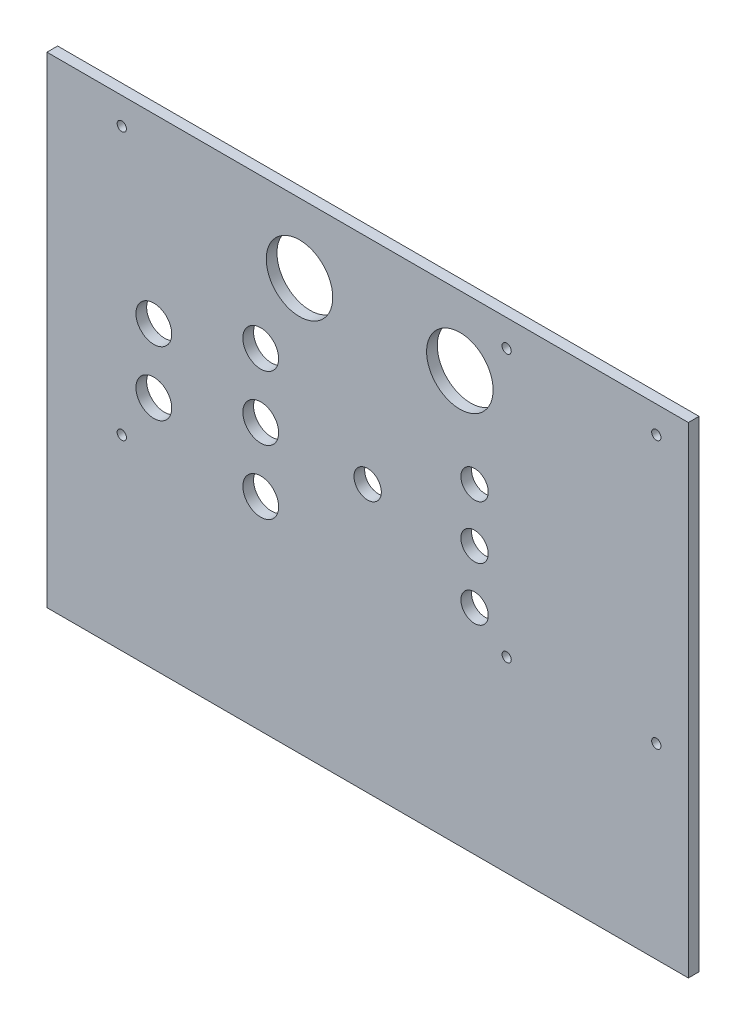
ISO-10303-21;
HEADER;
FILE_DESCRIPTION(('STEP AP214'),'2;1');
FILE_NAME('part.step','',(''),(''),'','','');
FILE_SCHEMA(('AUTOMOTIVE_DESIGN { 1 0 10303 214 1 1 1 1 }'));
ENDSEC;
DATA;
#1=APPLICATION_CONTEXT('core data for automotive mechanical design processes');
#2=APPLICATION_PROTOCOL_DEFINITION('international standard','automotive_design',2000,#1);
#3=PRODUCT_CONTEXT('',#1,'mechanical');
#4=PRODUCT('Part','Part','',(#3));
#5=PRODUCT_RELATED_PRODUCT_CATEGORY('part','',(#4));
#6=PRODUCT_DEFINITION_FORMATION('','',#4);
#7=PRODUCT_DEFINITION_CONTEXT('part definition',#1,'design');
#8=PRODUCT_DEFINITION('design','',#6,#7);
#9=PRODUCT_DEFINITION_SHAPE('','',#8);
#10=(LENGTH_UNIT() NAMED_UNIT(*) SI_UNIT(.MILLI.,.METRE.));
#11=(NAMED_UNIT(*) PLANE_ANGLE_UNIT() SI_UNIT($,.RADIAN.));
#12=(NAMED_UNIT(*) SI_UNIT($,.STERADIAN.) SOLID_ANGLE_UNIT());
#13=UNCERTAINTY_MEASURE_WITH_UNIT(LENGTH_MEASURE(1.E-05),#10,'distance_accuracy_value','');
#14=(GEOMETRIC_REPRESENTATION_CONTEXT(3) GLOBAL_UNCERTAINTY_ASSIGNED_CONTEXT((#13)) GLOBAL_UNIT_ASSIGNED_CONTEXT((#10,
#11,#12)) REPRESENTATION_CONTEXT('',''));
#15=CARTESIAN_POINT('',(0.,0.,0.));
#16=DIRECTION('',(0.,0.,1.));
#17=DIRECTION('',(1.,0.,0.));
#18=AXIS2_PLACEMENT_3D('',#15,#16,#17);
#19=CARTESIAN_POINT('',(0.,0.,2.54));
#20=DIRECTION('',(0.,0.,-1.));
#21=DIRECTION('',(-1.,0.,0.));
#22=AXIS2_PLACEMENT_3D('',#19,#20,#21);
#23=PLANE('',#22);
#24=DIRECTION('',(0.,-1.,0.));
#25=VECTOR('',#24,1.);
#26=CARTESIAN_POINT('',(0.,0.,2.54));
#27=LINE('',#26,#25);
#28=CARTESIAN_POINT('',(0.,114.3,2.54));
#29=VERTEX_POINT('',#28);
#30=CARTESIAN_POINT('',(0.,0.,2.54));
#31=VERTEX_POINT('',#30);
#32=EDGE_CURVE('E92',#29,#31,#27,.T.);
#33=ORIENTED_EDGE('',*,*,#32,.T.);
#34=DIRECTION('',(1.,0.,0.));
#35=VECTOR('',#34,1.);
#36=CARTESIAN_POINT('',(0.,0.,2.54));
#37=LINE('',#36,#35);
#38=CARTESIAN_POINT('',(152.4,0.,2.54));
#39=VERTEX_POINT('',#38);
#40=EDGE_CURVE('E87',#31,#39,#37,.T.);
#41=ORIENTED_EDGE('',*,*,#40,.T.);
#42=DIRECTION('',(0.,1.,0.));
#43=VECTOR('',#42,1.);
#44=CARTESIAN_POINT('',(152.4,0.,2.54));
#45=LINE('',#44,#43);
#46=CARTESIAN_POINT('',(152.4,114.3,2.54));
#47=VERTEX_POINT('',#46);
#48=EDGE_CURVE('E90',#39,#47,#45,.T.);
#49=ORIENTED_EDGE('',*,*,#48,.T.);
#50=DIRECTION('',(-1.,0.,0.));
#51=VECTOR('',#50,1.);
#52=CARTESIAN_POINT('',(0.,114.3,2.54));
#53=LINE('',#52,#51);
#54=EDGE_CURVE('E57',#47,#29,#53,.T.);
#55=ORIENTED_EDGE('',*,*,#54,.T.);
#56=EDGE_LOOP('',(#33,#41,#49,#55));
#57=FACE_BOUND('',#56,.T.);
#58=CARTESIAN_POINT('',(60.0071942494432,97.79,2.54));
#59=DIRECTION('',(0.,0.,1.));
#60=DIRECTION('',(1.,0.,0.));
#61=AXIS2_PLACEMENT_3D('',#58,#59,#60);
#62=CIRCLE('',#61,7.9);
#63=CARTESIAN_POINT('',(67.9071942494432,97.79,2.54));
#64=VERTEX_POINT('',#63);
#65=EDGE_CURVE('E112',#64,#64,#62,.T.);
#66=ORIENTED_EDGE('',*,*,#65,.F.);
#67=EDGE_LOOP('',(#66));
#68=FACE_BOUND('',#67,.T.);
#69=CARTESIAN_POINT('',(98.1071942494432,97.79,2.54));
#70=DIRECTION('',(0.,0.,1.));
#71=DIRECTION('',(1.,0.,0.));
#72=AXIS2_PLACEMENT_3D('',#69,#70,#71);
#73=CIRCLE('',#72,7.89999994800001);
#74=CARTESIAN_POINT('',(106.007194197443,97.79,2.54));
#75=VERTEX_POINT('',#74);
#76=EDGE_CURVE('E134',#75,#75,#73,.T.);
#77=ORIENTED_EDGE('',*,*,#76,.F.);
#78=EDGE_LOOP('',(#77));
#79=FACE_BOUND('',#78,.T.);
#80=CARTESIAN_POINT('',(50.8,78.74,2.54));
#81=DIRECTION('',(0.,0.,1.));
#82=DIRECTION('',(1.,0.,0.));
#83=AXIS2_PLACEMENT_3D('',#80,#81,#82);
#84=CIRCLE('',#83,4.25000000000001);
#85=CARTESIAN_POINT('',(55.05,78.74,2.54));
#86=VERTEX_POINT('',#85);
#87=EDGE_CURVE('E142',#86,#86,#84,.T.);
#88=ORIENTED_EDGE('',*,*,#87,.F.);
#89=EDGE_LOOP('',(#88));
#90=FACE_BOUND('',#89,.T.);
#91=CARTESIAN_POINT('',(25.4,71.12,2.54));
#92=DIRECTION('',(0.,0.,1.));
#93=DIRECTION('',(1.,0.,0.));
#94=AXIS2_PLACEMENT_3D('',#91,#92,#93);
#95=CIRCLE('',#94,4.25000000000001);
#96=CARTESIAN_POINT('',(29.65,71.12,2.54));
#97=VERTEX_POINT('',#96);
#98=EDGE_CURVE('E150',#97,#97,#95,.T.);
#99=ORIENTED_EDGE('',*,*,#98,.F.);
#100=EDGE_LOOP('',(#99));
#101=FACE_BOUND('',#100,.T.);
#102=CARTESIAN_POINT('',(50.8,63.5,2.54));
#103=DIRECTION('',(0.,0.,1.));
#104=DIRECTION('',(1.,0.,0.));
#105=AXIS2_PLACEMENT_3D('',#102,#103,#104);
#106=CIRCLE('',#105,4.25000000000001);
#107=CARTESIAN_POINT('',(55.05,63.5,2.54));
#108=VERTEX_POINT('',#107);
#109=EDGE_CURVE('E158',#108,#108,#106,.T.);
#110=ORIENTED_EDGE('',*,*,#109,.F.);
#111=EDGE_LOOP('',(#110));
#112=FACE_BOUND('',#111,.T.);
#113=CARTESIAN_POINT('',(101.6,63.5,2.54));
#114=DIRECTION('',(0.,0.,1.));
#115=DIRECTION('',(1.,0.,0.));
#116=AXIS2_PLACEMENT_3D('',#113,#114,#115);
#117=CIRCLE('',#116,3.25000000000001);
#118=CARTESIAN_POINT('',(104.85,63.5,2.54));
#119=VERTEX_POINT('',#118);
#120=EDGE_CURVE('E166',#119,#119,#117,.T.);
#121=ORIENTED_EDGE('',*,*,#120,.F.);
#122=EDGE_LOOP('',(#121));
#123=FACE_BOUND('',#122,.T.);
#124=CARTESIAN_POINT('',(50.8,48.26,2.54));
#125=DIRECTION('',(0.,0.,1.));
#126=DIRECTION('',(1.,0.,0.));
#127=AXIS2_PLACEMENT_3D('',#124,#125,#126);
#128=CIRCLE('',#127,4.25000000000001);
#129=CARTESIAN_POINT('',(55.05,48.26,2.54));
#130=VERTEX_POINT('',#129);
#131=EDGE_CURVE('E174',#130,#130,#128,.T.);
#132=ORIENTED_EDGE('',*,*,#131,.F.);
#133=EDGE_LOOP('',(#132));
#134=FACE_BOUND('',#133,.T.);
#135=CARTESIAN_POINT('',(25.4,55.88,2.54));
#136=DIRECTION('',(0.,0.,1.));
#137=DIRECTION('',(1.,0.,0.));
#138=AXIS2_PLACEMENT_3D('',#135,#136,#137);
#139=CIRCLE('',#138,4.25000000000001);
#140=CARTESIAN_POINT('',(29.65,55.88,2.54));
#141=VERTEX_POINT('',#140);
#142=EDGE_CURVE('E182',#141,#141,#139,.T.);
#143=ORIENTED_EDGE('',*,*,#142,.F.);
#144=EDGE_LOOP('',(#143));
#145=FACE_BOUND('',#144,.T.);
#146=CARTESIAN_POINT('',(101.6,50.8,2.54));
#147=DIRECTION('',(0.,0.,1.));
#148=DIRECTION('',(1.,0.,0.));
#149=AXIS2_PLACEMENT_3D('',#146,#147,#148);
#150=CIRCLE('',#149,3.25000000000001);
#151=CARTESIAN_POINT('',(104.85,50.8,2.54));
#152=VERTEX_POINT('',#151);
#153=EDGE_CURVE('E190',#152,#152,#150,.T.);
#154=ORIENTED_EDGE('',*,*,#153,.F.);
#155=EDGE_LOOP('',(#154));
#156=FACE_BOUND('',#155,.T.);
#157=CARTESIAN_POINT('',(17.78,44.45,2.54));
#158=DIRECTION('',(0.,0.,1.));
#159=DIRECTION('',(1.,0.,0.));
#160=AXIS2_PLACEMENT_3D('',#157,#158,#159);
#161=CIRCLE('',#160,1.09999999999999);
#162=CARTESIAN_POINT('',(18.88,44.45,2.54));
#163=VERTEX_POINT('',#162);
#164=EDGE_CURVE('E198',#163,#163,#161,.T.);
#165=ORIENTED_EDGE('',*,*,#164,.F.);
#166=EDGE_LOOP('',(#165));
#167=FACE_BOUND('',#166,.T.);
#168=CARTESIAN_POINT('',(17.78,107.95,2.54));
#169=DIRECTION('',(0.,0.,1.));
#170=DIRECTION('',(1.,0.,0.));
#171=AXIS2_PLACEMENT_3D('',#168,#169,#170);
#172=CIRCLE('',#171,1.1);
#173=CARTESIAN_POINT('',(18.88,107.95,2.54));
#174=VERTEX_POINT('',#173);
#175=EDGE_CURVE('E206',#174,#174,#172,.T.);
#176=ORIENTED_EDGE('',*,*,#175,.F.);
#177=EDGE_LOOP('',(#176));
#178=FACE_BOUND('',#177,.T.);
#179=CARTESIAN_POINT('',(109.22,107.95,2.54));
#180=DIRECTION('',(0.,0.,1.));
#181=DIRECTION('',(1.,0.,0.));
#182=AXIS2_PLACEMENT_3D('',#179,#180,#181);
#183=CIRCLE('',#182,1.10000000000001);
#184=CARTESIAN_POINT('',(110.32,107.95,2.54));
#185=VERTEX_POINT('',#184);
#186=EDGE_CURVE('E214',#185,#185,#183,.T.);
#187=ORIENTED_EDGE('',*,*,#186,.F.);
#188=EDGE_LOOP('',(#187));
#189=FACE_BOUND('',#188,.T.);
#190=CARTESIAN_POINT('',(76.2,63.5,2.54));
#191=DIRECTION('',(0.,0.,1.));
#192=DIRECTION('',(1.,0.,0.));
#193=AXIS2_PLACEMENT_3D('',#190,#191,#192);
#194=CIRCLE('',#193,3.25000000000002);
#195=CARTESIAN_POINT('',(79.45,63.5,2.54));
#196=VERTEX_POINT('',#195);
#197=EDGE_CURVE('E222',#196,#196,#194,.T.);
#198=ORIENTED_EDGE('',*,*,#197,.F.);
#199=EDGE_LOOP('',(#198));
#200=FACE_BOUND('',#199,.T.);
#201=CARTESIAN_POINT('',(109.22,44.45,2.54));
#202=DIRECTION('',(0.,0.,1.));
#203=DIRECTION('',(1.,0.,0.));
#204=AXIS2_PLACEMENT_3D('',#201,#202,#203);
#205=CIRCLE('',#204,1.10000000000001);
#206=CARTESIAN_POINT('',(110.32,44.45,2.54));
#207=VERTEX_POINT('',#206);
#208=EDGE_CURVE('E230',#207,#207,#205,.T.);
#209=ORIENTED_EDGE('',*,*,#208,.F.);
#210=EDGE_LOOP('',(#209));
#211=FACE_BOUND('',#210,.T.);
#212=CARTESIAN_POINT('',(144.78,44.45,2.54));
#213=DIRECTION('',(0.,0.,1.));
#214=DIRECTION('',(1.,0.,0.));
#215=AXIS2_PLACEMENT_3D('',#212,#213,#214);
#216=CIRCLE('',#215,1.10000000000002);
#217=CARTESIAN_POINT('',(145.88,44.45,2.54));
#218=VERTEX_POINT('',#217);
#219=EDGE_CURVE('E238',#218,#218,#216,.T.);
#220=ORIENTED_EDGE('',*,*,#219,.F.);
#221=EDGE_LOOP('',(#220));
#222=FACE_BOUND('',#221,.T.);
#223=CARTESIAN_POINT('',(101.6,76.2,2.54));
#224=DIRECTION('',(0.,0.,1.));
#225=DIRECTION('',(1.,0.,0.));
#226=AXIS2_PLACEMENT_3D('',#223,#224,#225);
#227=CIRCLE('',#226,3.25000000000001);
#228=CARTESIAN_POINT('',(104.85,76.2,2.54));
#229=VERTEX_POINT('',#228);
#230=EDGE_CURVE('E246',#229,#229,#227,.T.);
#231=ORIENTED_EDGE('',*,*,#230,.F.);
#232=EDGE_LOOP('',(#231));
#233=FACE_BOUND('',#232,.T.);
#234=CARTESIAN_POINT('',(144.78,107.95,2.54));
#235=DIRECTION('',(0.,0.,1.));
#236=DIRECTION('',(1.,0.,0.));
#237=AXIS2_PLACEMENT_3D('',#234,#235,#236);
#238=CIRCLE('',#237,1.10000000000002);
#239=CARTESIAN_POINT('',(145.88,107.95,2.54));
#240=VERTEX_POINT('',#239);
#241=EDGE_CURVE('E254',#240,#240,#238,.T.);
#242=ORIENTED_EDGE('',*,*,#241,.F.);
#243=EDGE_LOOP('',(#242));
#244=FACE_BOUND('',#243,.T.);
#245=ADVANCED_FACE('F39',(#57,#68,#79,#90,#101,#112,#123,#134,#145,#156,#167,#178,#189,#200,
#211,#222,#233,#244),#23,.F.);
#246=CARTESIAN_POINT('',(0.,0.,0.));
#247=DIRECTION('',(0.,0.,-1.));
#248=DIRECTION('',(-1.,0.,0.));
#249=AXIS2_PLACEMENT_3D('',#246,#247,#248);
#250=PLANE('',#249);
#251=CARTESIAN_POINT('',(101.6,76.2,0.));
#252=DIRECTION('',(0.,0.,1.));
#253=DIRECTION('',(1.,0.,0.));
#254=AXIS2_PLACEMENT_3D('',#251,#252,#253);
#255=CIRCLE('',#254,3.25000000000001);
#256=CARTESIAN_POINT('',(104.85,76.2,0.));
#257=VERTEX_POINT('',#256);
#258=EDGE_CURVE('E250',#257,#257,#255,.T.);
#259=ORIENTED_EDGE('',*,*,#258,.T.);
#260=EDGE_LOOP('',(#259));
#261=FACE_BOUND('',#260,.T.);
#262=CARTESIAN_POINT('',(109.22,44.45,0.));
#263=DIRECTION('',(0.,0.,1.));
#264=DIRECTION('',(1.,0.,0.));
#265=AXIS2_PLACEMENT_3D('',#262,#263,#264);
#266=CIRCLE('',#265,1.10000000000001);
#267=CARTESIAN_POINT('',(110.32,44.45,0.));
#268=VERTEX_POINT('',#267);
#269=EDGE_CURVE('E234',#268,#268,#266,.T.);
#270=ORIENTED_EDGE('',*,*,#269,.T.);
#271=EDGE_LOOP('',(#270));
#272=FACE_BOUND('',#271,.T.);
#273=CARTESIAN_POINT('',(109.22,107.95,0.));
#274=DIRECTION('',(0.,0.,1.));
#275=DIRECTION('',(1.,0.,0.));
#276=AXIS2_PLACEMENT_3D('',#273,#274,#275);
#277=CIRCLE('',#276,1.10000000000001);
#278=CARTESIAN_POINT('',(110.32,107.95,0.));
#279=VERTEX_POINT('',#278);
#280=EDGE_CURVE('E218',#279,#279,#277,.T.);
#281=ORIENTED_EDGE('',*,*,#280,.T.);
#282=EDGE_LOOP('',(#281));
#283=FACE_BOUND('',#282,.T.);
#284=CARTESIAN_POINT('',(17.78,44.45,0.));
#285=DIRECTION('',(0.,0.,1.));
#286=DIRECTION('',(1.,0.,0.));
#287=AXIS2_PLACEMENT_3D('',#284,#285,#286);
#288=CIRCLE('',#287,1.09999999999999);
#289=CARTESIAN_POINT('',(18.88,44.45,0.));
#290=VERTEX_POINT('',#289);
#291=EDGE_CURVE('E202',#290,#290,#288,.T.);
#292=ORIENTED_EDGE('',*,*,#291,.T.);
#293=EDGE_LOOP('',(#292));
#294=FACE_BOUND('',#293,.T.);
#295=CARTESIAN_POINT('',(25.4,55.88,0.));
#296=DIRECTION('',(0.,0.,1.));
#297=DIRECTION('',(1.,0.,0.));
#298=AXIS2_PLACEMENT_3D('',#295,#296,#297);
#299=CIRCLE('',#298,4.25000000000001);
#300=CARTESIAN_POINT('',(29.65,55.88,0.));
#301=VERTEX_POINT('',#300);
#302=EDGE_CURVE('E186',#301,#301,#299,.T.);
#303=ORIENTED_EDGE('',*,*,#302,.T.);
#304=EDGE_LOOP('',(#303));
#305=FACE_BOUND('',#304,.T.);
#306=CARTESIAN_POINT('',(101.6,63.5,0.));
#307=DIRECTION('',(0.,0.,1.));
#308=DIRECTION('',(1.,0.,0.));
#309=AXIS2_PLACEMENT_3D('',#306,#307,#308);
#310=CIRCLE('',#309,3.25000000000001);
#311=CARTESIAN_POINT('',(104.85,63.5,0.));
#312=VERTEX_POINT('',#311);
#313=EDGE_CURVE('E170',#312,#312,#310,.T.);
#314=ORIENTED_EDGE('',*,*,#313,.T.);
#315=EDGE_LOOP('',(#314));
#316=FACE_BOUND('',#315,.T.);
#317=CARTESIAN_POINT('',(25.4,71.12,0.));
#318=DIRECTION('',(0.,0.,1.));
#319=DIRECTION('',(1.,0.,0.));
#320=AXIS2_PLACEMENT_3D('',#317,#318,#319);
#321=CIRCLE('',#320,4.25000000000001);
#322=CARTESIAN_POINT('',(29.65,71.12,0.));
#323=VERTEX_POINT('',#322);
#324=EDGE_CURVE('E154',#323,#323,#321,.T.);
#325=ORIENTED_EDGE('',*,*,#324,.T.);
#326=EDGE_LOOP('',(#325));
#327=FACE_BOUND('',#326,.T.);
#328=CARTESIAN_POINT('',(98.1071942494432,97.79,0.));
#329=DIRECTION('',(0.,0.,1.));
#330=DIRECTION('',(1.,0.,0.));
#331=AXIS2_PLACEMENT_3D('',#328,#329,#330);
#332=CIRCLE('',#331,7.89999994800001);
#333=CARTESIAN_POINT('',(106.007194197443,97.79,0.));
#334=VERTEX_POINT('',#333);
#335=EDGE_CURVE('E138',#334,#334,#332,.T.);
#336=ORIENTED_EDGE('',*,*,#335,.T.);
#337=EDGE_LOOP('',(#336));
#338=FACE_BOUND('',#337,.T.);
#339=DIRECTION('',(0.,-1.,0.));
#340=VECTOR('',#339,1.);
#341=CARTESIAN_POINT('',(0.,0.,0.));
#342=LINE('',#341,#340);
#343=CARTESIAN_POINT('',(0.,114.3,0.));
#344=VERTEX_POINT('',#343);
#345=CARTESIAN_POINT('',(0.,0.,0.));
#346=VERTEX_POINT('',#345);
#347=EDGE_CURVE('E108',#344,#346,#342,.T.);
#348=ORIENTED_EDGE('',*,*,#347,.F.);
#349=DIRECTION('',(-1.,0.,0.));
#350=VECTOR('',#349,1.);
#351=CARTESIAN_POINT('',(0.,114.3,0.));
#352=LINE('',#351,#350);
#353=CARTESIAN_POINT('',(152.4,114.3,0.));
#354=VERTEX_POINT('',#353);
#355=EDGE_CURVE('E80',#354,#344,#352,.T.);
#356=ORIENTED_EDGE('',*,*,#355,.F.);
#357=DIRECTION('',(0.,1.,0.));
#358=VECTOR('',#357,1.);
#359=CARTESIAN_POINT('',(152.4,0.,0.));
#360=LINE('',#359,#358);
#361=CARTESIAN_POINT('',(152.4,0.,0.));
#362=VERTEX_POINT('',#361);
#363=EDGE_CURVE('E74',#362,#354,#360,.T.);
#364=ORIENTED_EDGE('',*,*,#363,.F.);
#365=DIRECTION('',(1.,0.,0.));
#366=VECTOR('',#365,1.);
#367=CARTESIAN_POINT('',(0.,0.,0.));
#368=LINE('',#367,#366);
#369=EDGE_CURVE('E97',#346,#362,#368,.T.);
#370=ORIENTED_EDGE('',*,*,#369,.F.);
#371=EDGE_LOOP('',(#348,#356,#364,#370));
#372=FACE_BOUND('',#371,.T.);
#373=CARTESIAN_POINT('',(60.0071942494432,97.79,0.));
#374=DIRECTION('',(0.,0.,1.));
#375=DIRECTION('',(1.,0.,0.));
#376=AXIS2_PLACEMENT_3D('',#373,#374,#375);
#377=CIRCLE('',#376,7.9);
#378=CARTESIAN_POINT('',(67.9071942494432,97.79,0.));
#379=VERTEX_POINT('',#378);
#380=EDGE_CURVE('E130',#379,#379,#377,.T.);
#381=ORIENTED_EDGE('',*,*,#380,.T.);
#382=EDGE_LOOP('',(#381));
#383=FACE_BOUND('',#382,.T.);
#384=CARTESIAN_POINT('',(50.8,78.74,0.));
#385=DIRECTION('',(0.,0.,1.));
#386=DIRECTION('',(1.,0.,0.));
#387=AXIS2_PLACEMENT_3D('',#384,#385,#386);
#388=CIRCLE('',#387,4.25000000000001);
#389=CARTESIAN_POINT('',(55.05,78.74,0.));
#390=VERTEX_POINT('',#389);
#391=EDGE_CURVE('E146',#390,#390,#388,.T.);
#392=ORIENTED_EDGE('',*,*,#391,.T.);
#393=EDGE_LOOP('',(#392));
#394=FACE_BOUND('',#393,.T.);
#395=CARTESIAN_POINT('',(50.8,63.5,0.));
#396=DIRECTION('',(0.,0.,1.));
#397=DIRECTION('',(1.,0.,0.));
#398=AXIS2_PLACEMENT_3D('',#395,#396,#397);
#399=CIRCLE('',#398,4.25000000000001);
#400=CARTESIAN_POINT('',(55.05,63.5,0.));
#401=VERTEX_POINT('',#400);
#402=EDGE_CURVE('E162',#401,#401,#399,.T.);
#403=ORIENTED_EDGE('',*,*,#402,.T.);
#404=EDGE_LOOP('',(#403));
#405=FACE_BOUND('',#404,.T.);
#406=CARTESIAN_POINT('',(50.8,48.26,0.));
#407=DIRECTION('',(0.,0.,1.));
#408=DIRECTION('',(1.,0.,0.));
#409=AXIS2_PLACEMENT_3D('',#406,#407,#408);
#410=CIRCLE('',#409,4.25000000000001);
#411=CARTESIAN_POINT('',(55.05,48.26,0.));
#412=VERTEX_POINT('',#411);
#413=EDGE_CURVE('E178',#412,#412,#410,.T.);
#414=ORIENTED_EDGE('',*,*,#413,.T.);
#415=EDGE_LOOP('',(#414));
#416=FACE_BOUND('',#415,.T.);
#417=CARTESIAN_POINT('',(101.6,50.8,0.));
#418=DIRECTION('',(0.,0.,1.));
#419=DIRECTION('',(1.,0.,0.));
#420=AXIS2_PLACEMENT_3D('',#417,#418,#419);
#421=CIRCLE('',#420,3.25000000000001);
#422=CARTESIAN_POINT('',(104.85,50.8,0.));
#423=VERTEX_POINT('',#422);
#424=EDGE_CURVE('E194',#423,#423,#421,.T.);
#425=ORIENTED_EDGE('',*,*,#424,.T.);
#426=EDGE_LOOP('',(#425));
#427=FACE_BOUND('',#426,.T.);
#428=CARTESIAN_POINT('',(17.78,107.95,0.));
#429=DIRECTION('',(0.,0.,1.));
#430=DIRECTION('',(1.,0.,0.));
#431=AXIS2_PLACEMENT_3D('',#428,#429,#430);
#432=CIRCLE('',#431,1.1);
#433=CARTESIAN_POINT('',(18.88,107.95,0.));
#434=VERTEX_POINT('',#433);
#435=EDGE_CURVE('E210',#434,#434,#432,.T.);
#436=ORIENTED_EDGE('',*,*,#435,.T.);
#437=EDGE_LOOP('',(#436));
#438=FACE_BOUND('',#437,.T.);
#439=CARTESIAN_POINT('',(76.2,63.5,0.));
#440=DIRECTION('',(0.,0.,1.));
#441=DIRECTION('',(1.,0.,0.));
#442=AXIS2_PLACEMENT_3D('',#439,#440,#441);
#443=CIRCLE('',#442,3.25000000000002);
#444=CARTESIAN_POINT('',(79.45,63.5,0.));
#445=VERTEX_POINT('',#444);
#446=EDGE_CURVE('E226',#445,#445,#443,.T.);
#447=ORIENTED_EDGE('',*,*,#446,.T.);
#448=EDGE_LOOP('',(#447));
#449=FACE_BOUND('',#448,.T.);
#450=CARTESIAN_POINT('',(144.78,44.45,0.));
#451=DIRECTION('',(0.,0.,1.));
#452=DIRECTION('',(1.,0.,0.));
#453=AXIS2_PLACEMENT_3D('',#450,#451,#452);
#454=CIRCLE('',#453,1.10000000000002);
#455=CARTESIAN_POINT('',(145.88,44.45,0.));
#456=VERTEX_POINT('',#455);
#457=EDGE_CURVE('E242',#456,#456,#454,.T.);
#458=ORIENTED_EDGE('',*,*,#457,.T.);
#459=EDGE_LOOP('',(#458));
#460=FACE_BOUND('',#459,.T.);
#461=CARTESIAN_POINT('',(144.78,107.95,0.));
#462=DIRECTION('',(0.,0.,1.));
#463=DIRECTION('',(1.,0.,0.));
#464=AXIS2_PLACEMENT_3D('',#461,#462,#463);
#465=CIRCLE('',#464,1.10000000000002);
#466=CARTESIAN_POINT('',(145.88,107.95,0.));
#467=VERTEX_POINT('',#466);
#468=EDGE_CURVE('E258',#467,#467,#465,.T.);
#469=ORIENTED_EDGE('',*,*,#468,.T.);
#470=EDGE_LOOP('',(#469));
#471=FACE_BOUND('',#470,.T.);
#472=ADVANCED_FACE('F125',(#261,#272,#283,#294,#305,#316,#327,#338,#372,#383,#394,#405,#416,
#427,#438,#449,#460,#471),#250,.T.);
#473=CARTESIAN_POINT('',(0.,0.,2.54));
#474=DIRECTION('',(1.,0.,0.));
#475=DIRECTION('',(0.,1.,0.));
#476=AXIS2_PLACEMENT_3D('',#473,#474,#475);
#477=PLANE('',#476);
#478=ORIENTED_EDGE('',*,*,#347,.T.);
#479=DIRECTION('',(0.,0.,-1.));
#480=VECTOR('',#479,1.);
#481=CARTESIAN_POINT('',(0.,0.,2.54));
#482=LINE('',#481,#480);
#483=EDGE_CURVE('E11',#31,#346,#482,.T.);
#484=ORIENTED_EDGE('',*,*,#483,.F.);
#485=ORIENTED_EDGE('',*,*,#32,.F.);
#486=DIRECTION('',(0.,0.,-1.));
#487=VECTOR('',#486,1.);
#488=CARTESIAN_POINT('',(0.,114.3,2.54));
#489=LINE('',#488,#487);
#490=EDGE_CURVE('E104',#29,#344,#489,.T.);
#491=ORIENTED_EDGE('',*,*,#490,.T.);
#492=EDGE_LOOP('',(#478,#484,#485,#491));
#493=FACE_BOUND('',#492,.T.);
#494=ADVANCED_FACE('F41',(#493),#477,.F.);
#495=CARTESIAN_POINT('',(0.,0.,2.54));
#496=DIRECTION('',(0.,1.,0.));
#497=DIRECTION('',(0.,0.,1.));
#498=AXIS2_PLACEMENT_3D('',#495,#496,#497);
#499=PLANE('',#498);
#500=ORIENTED_EDGE('',*,*,#369,.T.);
#501=DIRECTION('',(0.,0.,-1.));
#502=VECTOR('',#501,1.);
#503=CARTESIAN_POINT('',(152.4,0.,2.54));
#504=LINE('',#503,#502);
#505=EDGE_CURVE('E49',#39,#362,#504,.T.);
#506=ORIENTED_EDGE('',*,*,#505,.F.);
#507=ORIENTED_EDGE('',*,*,#40,.F.);
#508=ORIENTED_EDGE('',*,*,#483,.T.);
#509=EDGE_LOOP('',(#500,#506,#507,#508));
#510=FACE_BOUND('',#509,.T.);
#511=ADVANCED_FACE('F96',(#510),#499,.F.);
#512=CARTESIAN_POINT('',(152.4,0.,2.54));
#513=DIRECTION('',(-1.,0.,0.));
#514=DIRECTION('',(0.,-1.,0.));
#515=AXIS2_PLACEMENT_3D('',#512,#513,#514);
#516=PLANE('',#515);
#517=ORIENTED_EDGE('',*,*,#363,.T.);
#518=DIRECTION('',(0.,0.,-1.));
#519=VECTOR('',#518,1.);
#520=CARTESIAN_POINT('',(152.4,114.3,2.54));
#521=LINE('',#520,#519);
#522=EDGE_CURVE('E99',#47,#354,#521,.T.);
#523=ORIENTED_EDGE('',*,*,#522,.F.);
#524=ORIENTED_EDGE('',*,*,#48,.F.);
#525=ORIENTED_EDGE('',*,*,#505,.T.);
#526=EDGE_LOOP('',(#517,#523,#524,#525));
#527=FACE_BOUND('',#526,.T.);
#528=ADVANCED_FACE('F100',(#527),#516,.F.);
#529=CARTESIAN_POINT('',(0.,114.3,2.54));
#530=DIRECTION('',(0.,-1.,0.));
#531=DIRECTION('',(0.,0.,-1.));
#532=AXIS2_PLACEMENT_3D('',#529,#530,#531);
#533=PLANE('',#532);
#534=ORIENTED_EDGE('',*,*,#355,.T.);
#535=ORIENTED_EDGE('',*,*,#490,.F.);
#536=ORIENTED_EDGE('',*,*,#54,.F.);
#537=ORIENTED_EDGE('',*,*,#522,.T.);
#538=EDGE_LOOP('',(#534,#535,#536,#537));
#539=FACE_BOUND('',#538,.T.);
#540=ADVANCED_FACE('F122',(#539),#533,.F.);
#541=CARTESIAN_POINT('',(60.0071942494432,97.79,2.54));
#542=DIRECTION('',(0.,0.,-1.));
#543=DIRECTION('',(-1.,0.,0.));
#544=AXIS2_PLACEMENT_3D('',#541,#542,#543);
#545=CYLINDRICAL_SURFACE('',#544,7.9);
#546=ORIENTED_EDGE('',*,*,#65,.T.);
#547=EDGE_LOOP('',(#546));
#548=FACE_BOUND('',#547,.T.);
#549=ORIENTED_EDGE('',*,*,#380,.F.);
#550=EDGE_LOOP('',(#549));
#551=FACE_BOUND('',#550,.T.);
#552=ADVANCED_FACE('F277',(#548,#551),#545,.F.);
#553=CARTESIAN_POINT('',(98.1071942494432,97.79,2.54));
#554=DIRECTION('',(0.,0.,-1.));
#555=DIRECTION('',(-1.,0.,0.));
#556=AXIS2_PLACEMENT_3D('',#553,#554,#555);
#557=CYLINDRICAL_SURFACE('',#556,7.89999994800001);
#558=ORIENTED_EDGE('',*,*,#76,.T.);
#559=EDGE_LOOP('',(#558));
#560=FACE_BOUND('',#559,.T.);
#561=ORIENTED_EDGE('',*,*,#335,.F.);
#562=EDGE_LOOP('',(#561));
#563=FACE_BOUND('',#562,.T.);
#564=ADVANCED_FACE('F323',(#560,#563),#557,.F.);
#565=CARTESIAN_POINT('',(50.8,78.74,2.54));
#566=DIRECTION('',(0.,0.,-1.));
#567=DIRECTION('',(-1.,0.,0.));
#568=AXIS2_PLACEMENT_3D('',#565,#566,#567);
#569=CYLINDRICAL_SURFACE('',#568,4.25000000000001);
#570=ORIENTED_EDGE('',*,*,#87,.T.);
#571=EDGE_LOOP('',(#570));
#572=FACE_BOUND('',#571,.T.);
#573=ORIENTED_EDGE('',*,*,#391,.F.);
#574=EDGE_LOOP('',(#573));
#575=FACE_BOUND('',#574,.T.);
#576=ADVANCED_FACE('F331',(#572,#575),#569,.F.);
#577=CARTESIAN_POINT('',(25.4,71.12,2.54));
#578=DIRECTION('',(0.,0.,-1.));
#579=DIRECTION('',(-1.,0.,0.));
#580=AXIS2_PLACEMENT_3D('',#577,#578,#579);
#581=CYLINDRICAL_SURFACE('',#580,4.25000000000001);
#582=ORIENTED_EDGE('',*,*,#98,.T.);
#583=EDGE_LOOP('',(#582));
#584=FACE_BOUND('',#583,.T.);
#585=ORIENTED_EDGE('',*,*,#324,.F.);
#586=EDGE_LOOP('',(#585));
#587=FACE_BOUND('',#586,.T.);
#588=ADVANCED_FACE('F339',(#584,#587),#581,.F.);
#589=CARTESIAN_POINT('',(50.8,63.5,2.54));
#590=DIRECTION('',(0.,0.,-1.));
#591=DIRECTION('',(-1.,0.,0.));
#592=AXIS2_PLACEMENT_3D('',#589,#590,#591);
#593=CYLINDRICAL_SURFACE('',#592,4.25000000000001);
#594=ORIENTED_EDGE('',*,*,#109,.T.);
#595=EDGE_LOOP('',(#594));
#596=FACE_BOUND('',#595,.T.);
#597=ORIENTED_EDGE('',*,*,#402,.F.);
#598=EDGE_LOOP('',(#597));
#599=FACE_BOUND('',#598,.T.);
#600=ADVANCED_FACE('F348',(#596,#599),#593,.F.);
#601=CARTESIAN_POINT('',(101.6,63.5,2.54));
#602=DIRECTION('',(0.,0.,-1.));
#603=DIRECTION('',(-1.,0.,0.));
#604=AXIS2_PLACEMENT_3D('',#601,#602,#603);
#605=CYLINDRICAL_SURFACE('',#604,3.25000000000001);
#606=ORIENTED_EDGE('',*,*,#120,.T.);
#607=EDGE_LOOP('',(#606));
#608=FACE_BOUND('',#607,.T.);
#609=ORIENTED_EDGE('',*,*,#313,.F.);
#610=EDGE_LOOP('',(#609));
#611=FACE_BOUND('',#610,.T.);
#612=ADVANCED_FACE('F357',(#608,#611),#605,.F.);
#613=CARTESIAN_POINT('',(50.8,48.26,2.54));
#614=DIRECTION('',(0.,0.,-1.));
#615=DIRECTION('',(-1.,0.,0.));
#616=AXIS2_PLACEMENT_3D('',#613,#614,#615);
#617=CYLINDRICAL_SURFACE('',#616,4.25000000000001);
#618=ORIENTED_EDGE('',*,*,#131,.T.);
#619=EDGE_LOOP('',(#618));
#620=FACE_BOUND('',#619,.T.);
#621=ORIENTED_EDGE('',*,*,#413,.F.);
#622=EDGE_LOOP('',(#621));
#623=FACE_BOUND('',#622,.T.);
#624=ADVANCED_FACE('F366',(#620,#623),#617,.F.);
#625=CARTESIAN_POINT('',(25.4,55.88,2.54));
#626=DIRECTION('',(0.,0.,-1.));
#627=DIRECTION('',(-1.,0.,0.));
#628=AXIS2_PLACEMENT_3D('',#625,#626,#627);
#629=CYLINDRICAL_SURFACE('',#628,4.25000000000001);
#630=ORIENTED_EDGE('',*,*,#142,.T.);
#631=EDGE_LOOP('',(#630));
#632=FACE_BOUND('',#631,.T.);
#633=ORIENTED_EDGE('',*,*,#302,.F.);
#634=EDGE_LOOP('',(#633));
#635=FACE_BOUND('',#634,.T.);
#636=ADVANCED_FACE('F375',(#632,#635),#629,.F.);
#637=CARTESIAN_POINT('',(101.6,50.8,2.54));
#638=DIRECTION('',(0.,0.,-1.));
#639=DIRECTION('',(-1.,0.,0.));
#640=AXIS2_PLACEMENT_3D('',#637,#638,#639);
#641=CYLINDRICAL_SURFACE('',#640,3.25000000000001);
#642=ORIENTED_EDGE('',*,*,#153,.T.);
#643=EDGE_LOOP('',(#642));
#644=FACE_BOUND('',#643,.T.);
#645=ORIENTED_EDGE('',*,*,#424,.F.);
#646=EDGE_LOOP('',(#645));
#647=FACE_BOUND('',#646,.T.);
#648=ADVANCED_FACE('F384',(#644,#647),#641,.F.);
#649=CARTESIAN_POINT('',(17.78,44.45,2.54));
#650=DIRECTION('',(0.,0.,-1.));
#651=DIRECTION('',(-1.,0.,0.));
#652=AXIS2_PLACEMENT_3D('',#649,#650,#651);
#653=CYLINDRICAL_SURFACE('',#652,1.09999999999999);
#654=ORIENTED_EDGE('',*,*,#164,.T.);
#655=EDGE_LOOP('',(#654));
#656=FACE_BOUND('',#655,.T.);
#657=ORIENTED_EDGE('',*,*,#291,.F.);
#658=EDGE_LOOP('',(#657));
#659=FACE_BOUND('',#658,.T.);
#660=ADVANCED_FACE('F393',(#656,#659),#653,.F.);
#661=CARTESIAN_POINT('',(17.78,107.95,2.54));
#662=DIRECTION('',(0.,0.,-1.));
#663=DIRECTION('',(-1.,0.,0.));
#664=AXIS2_PLACEMENT_3D('',#661,#662,#663);
#665=CYLINDRICAL_SURFACE('',#664,1.1);
#666=ORIENTED_EDGE('',*,*,#175,.T.);
#667=EDGE_LOOP('',(#666));
#668=FACE_BOUND('',#667,.T.);
#669=ORIENTED_EDGE('',*,*,#435,.F.);
#670=EDGE_LOOP('',(#669));
#671=FACE_BOUND('',#670,.T.);
#672=ADVANCED_FACE('F402',(#668,#671),#665,.F.);
#673=CARTESIAN_POINT('',(109.22,107.95,2.54));
#674=DIRECTION('',(0.,0.,-1.));
#675=DIRECTION('',(-1.,0.,0.));
#676=AXIS2_PLACEMENT_3D('',#673,#674,#675);
#677=CYLINDRICAL_SURFACE('',#676,1.10000000000001);
#678=ORIENTED_EDGE('',*,*,#186,.T.);
#679=EDGE_LOOP('',(#678));
#680=FACE_BOUND('',#679,.T.);
#681=ORIENTED_EDGE('',*,*,#280,.F.);
#682=EDGE_LOOP('',(#681));
#683=FACE_BOUND('',#682,.T.);
#684=ADVANCED_FACE('F411',(#680,#683),#677,.F.);
#685=CARTESIAN_POINT('',(76.2,63.5,2.54));
#686=DIRECTION('',(0.,0.,-1.));
#687=DIRECTION('',(-1.,0.,0.));
#688=AXIS2_PLACEMENT_3D('',#685,#686,#687);
#689=CYLINDRICAL_SURFACE('',#688,3.25000000000002);
#690=ORIENTED_EDGE('',*,*,#197,.T.);
#691=EDGE_LOOP('',(#690));
#692=FACE_BOUND('',#691,.T.);
#693=ORIENTED_EDGE('',*,*,#446,.F.);
#694=EDGE_LOOP('',(#693));
#695=FACE_BOUND('',#694,.T.);
#696=ADVANCED_FACE('F420',(#692,#695),#689,.F.);
#697=CARTESIAN_POINT('',(109.22,44.45,2.54));
#698=DIRECTION('',(0.,0.,-1.));
#699=DIRECTION('',(-1.,0.,0.));
#700=AXIS2_PLACEMENT_3D('',#697,#698,#699);
#701=CYLINDRICAL_SURFACE('',#700,1.10000000000001);
#702=ORIENTED_EDGE('',*,*,#208,.T.);
#703=EDGE_LOOP('',(#702));
#704=FACE_BOUND('',#703,.T.);
#705=ORIENTED_EDGE('',*,*,#269,.F.);
#706=EDGE_LOOP('',(#705));
#707=FACE_BOUND('',#706,.T.);
#708=ADVANCED_FACE('F429',(#704,#707),#701,.F.);
#709=CARTESIAN_POINT('',(144.78,44.45,2.54));
#710=DIRECTION('',(0.,0.,-1.));
#711=DIRECTION('',(-1.,0.,0.));
#712=AXIS2_PLACEMENT_3D('',#709,#710,#711);
#713=CYLINDRICAL_SURFACE('',#712,1.10000000000002);
#714=ORIENTED_EDGE('',*,*,#219,.T.);
#715=EDGE_LOOP('',(#714));
#716=FACE_BOUND('',#715,.T.);
#717=ORIENTED_EDGE('',*,*,#457,.F.);
#718=EDGE_LOOP('',(#717));
#719=FACE_BOUND('',#718,.T.);
#720=ADVANCED_FACE('F438',(#716,#719),#713,.F.);
#721=CARTESIAN_POINT('',(101.6,76.2,2.54));
#722=DIRECTION('',(0.,0.,-1.));
#723=DIRECTION('',(-1.,0.,0.));
#724=AXIS2_PLACEMENT_3D('',#721,#722,#723);
#725=CYLINDRICAL_SURFACE('',#724,3.25000000000001);
#726=ORIENTED_EDGE('',*,*,#230,.T.);
#727=EDGE_LOOP('',(#726));
#728=FACE_BOUND('',#727,.T.);
#729=ORIENTED_EDGE('',*,*,#258,.F.);
#730=EDGE_LOOP('',(#729));
#731=FACE_BOUND('',#730,.T.);
#732=ADVANCED_FACE('F447',(#728,#731),#725,.F.);
#733=CARTESIAN_POINT('',(144.78,107.95,2.54));
#734=DIRECTION('',(0.,0.,-1.));
#735=DIRECTION('',(-1.,0.,0.));
#736=AXIS2_PLACEMENT_3D('',#733,#734,#735);
#737=CYLINDRICAL_SURFACE('',#736,1.10000000000002);
#738=ORIENTED_EDGE('',*,*,#241,.T.);
#739=EDGE_LOOP('',(#738));
#740=FACE_BOUND('',#739,.T.);
#741=ORIENTED_EDGE('',*,*,#468,.F.);
#742=EDGE_LOOP('',(#741));
#743=FACE_BOUND('',#742,.T.);
#744=ADVANCED_FACE('F266',(#740,#743),#737,.F.);
#745=CLOSED_SHELL('',(#245,#472,#494,#511,#528,#540,#552,#564,#576,#588,#600,#612,#624,#636,
#648,#660,#672,#684,#696,#708,#720,#732,#744));
#746=MANIFOLD_SOLID_BREP('B2',#745);
#747=ADVANCED_BREP_SHAPE_REPRESENTATION('',(#18,#746),#14);
#748=SHAPE_DEFINITION_REPRESENTATION(#9,#747);
ENDSEC;
END-ISO-10303-21;
